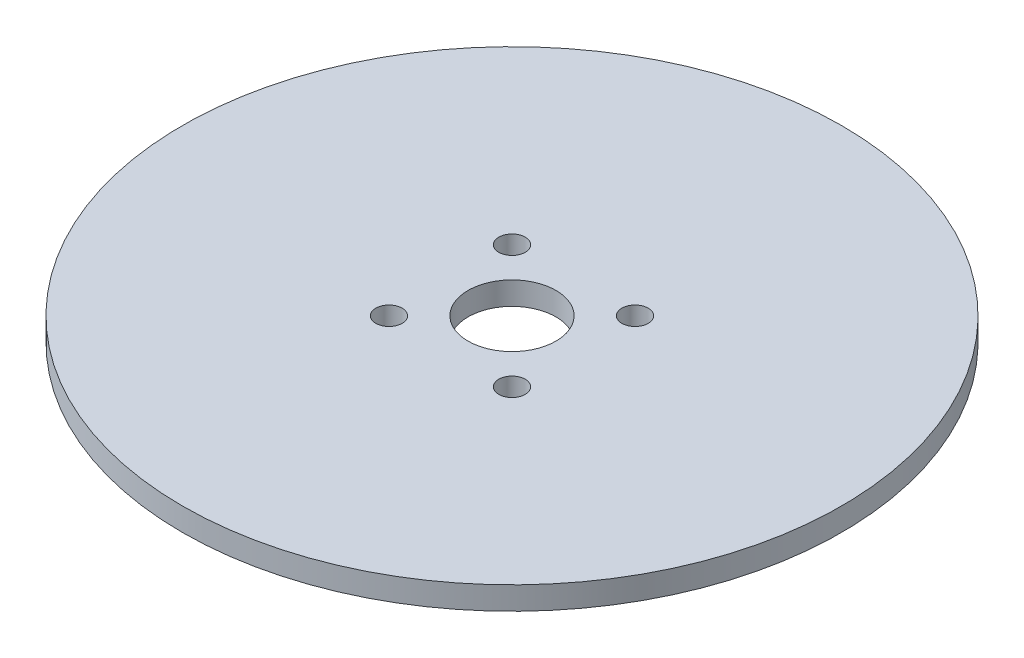
ISO-10303-21;
HEADER;
FILE_DESCRIPTION(('STEP AP214'),'2;1');
FILE_NAME('part.step','',(''),(''),'','','');
FILE_SCHEMA(('AUTOMOTIVE_DESIGN { 1 0 10303 214 1 1 1 1 }'));
ENDSEC;
DATA;
#1=APPLICATION_CONTEXT('core data for automotive mechanical design processes');
#2=APPLICATION_PROTOCOL_DEFINITION('international standard','automotive_design',2000,#1);
#3=PRODUCT_CONTEXT('',#1,'mechanical');
#4=PRODUCT('Part','Part','',(#3));
#5=PRODUCT_RELATED_PRODUCT_CATEGORY('part','',(#4));
#6=PRODUCT_DEFINITION_FORMATION('','',#4);
#7=PRODUCT_DEFINITION_CONTEXT('part definition',#1,'design');
#8=PRODUCT_DEFINITION('design','',#6,#7);
#9=PRODUCT_DEFINITION_SHAPE('','',#8);
#10=(LENGTH_UNIT() NAMED_UNIT(*) SI_UNIT(.MILLI.,.METRE.));
#11=(NAMED_UNIT(*) PLANE_ANGLE_UNIT() SI_UNIT($,.RADIAN.));
#12=(NAMED_UNIT(*) SI_UNIT($,.STERADIAN.) SOLID_ANGLE_UNIT());
#13=UNCERTAINTY_MEASURE_WITH_UNIT(LENGTH_MEASURE(1.E-05),#10,'distance_accuracy_value','');
#14=(GEOMETRIC_REPRESENTATION_CONTEXT(3) GLOBAL_UNCERTAINTY_ASSIGNED_CONTEXT((#13)) GLOBAL_UNIT_ASSIGNED_CONTEXT((#10,
#11,#12)) REPRESENTATION_CONTEXT('',''));
#15=CARTESIAN_POINT('',(0.,0.,0.));
#16=DIRECTION('',(0.,0.,1.));
#17=DIRECTION('',(1.,0.,0.));
#18=AXIS2_PLACEMENT_3D('',#15,#16,#17);
#19=CARTESIAN_POINT('',(0.,2.61,0.));
#20=DIRECTION('',(0.,-1.,0.));
#21=DIRECTION('',(0.,0.,-1.));
#22=AXIS2_PLACEMENT_3D('',#19,#20,#21);
#23=CYLINDRICAL_SURFACE('',#22,37.5);
#24=CARTESIAN_POINT('',(0.,2.61,0.));
#25=DIRECTION('',(0.,1.,0.));
#26=DIRECTION('',(0.,0.,1.));
#27=AXIS2_PLACEMENT_3D('',#24,#25,#26);
#28=CIRCLE('',#27,37.5);
#29=CARTESIAN_POINT('',(0.,2.61,37.5));
#30=VERTEX_POINT('',#29);
#31=EDGE_CURVE('E10',#30,#30,#28,.T.);
#32=ORIENTED_EDGE('',*,*,#31,.F.);
#33=EDGE_LOOP('',(#32));
#34=FACE_BOUND('',#33,.T.);
#35=CARTESIAN_POINT('',(0.,0.,0.));
#36=DIRECTION('',(0.,1.,0.));
#37=DIRECTION('',(0.,0.,1.));
#38=AXIS2_PLACEMENT_3D('',#35,#36,#37);
#39=CIRCLE('',#38,37.5);
#40=CARTESIAN_POINT('',(0.,0.,37.5));
#41=VERTEX_POINT('',#40);
#42=EDGE_CURVE('E45',#41,#41,#39,.T.);
#43=ORIENTED_EDGE('',*,*,#42,.T.);
#44=EDGE_LOOP('',(#43));
#45=FACE_BOUND('',#44,.T.);
#46=ADVANCED_FACE('F37',(#34,#45),#23,.T.);
#47=CARTESIAN_POINT('',(0.,2.61,0.));
#48=DIRECTION('',(0.,1.,0.));
#49=DIRECTION('',(0.,0.,1.));
#50=AXIS2_PLACEMENT_3D('',#47,#48,#49);
#51=PLANE('',#50);
#52=CARTESIAN_POINT('',(7.,2.61,7.));
#53=DIRECTION('',(0.,1.,0.));
#54=DIRECTION('',(0.,0.,1.));
#55=AXIS2_PLACEMENT_3D('',#52,#53,#54);
#56=CIRCLE('',#55,1.5);
#57=CARTESIAN_POINT('',(7.,2.61,8.5));
#58=VERTEX_POINT('',#57);
#59=EDGE_CURVE('E74',#58,#58,#56,.T.);
#60=ORIENTED_EDGE('',*,*,#59,.F.);
#61=EDGE_LOOP('',(#60));
#62=FACE_BOUND('',#61,.T.);
#63=CARTESIAN_POINT('',(-7.,2.61,-7.));
#64=DIRECTION('',(0.,1.,0.));
#65=DIRECTION('',(0.,0.,1.));
#66=AXIS2_PLACEMENT_3D('',#63,#64,#65);
#67=CIRCLE('',#66,1.5);
#68=CARTESIAN_POINT('',(-7.,2.61,-5.5));
#69=VERTEX_POINT('',#68);
#70=EDGE_CURVE('E65',#69,#69,#67,.T.);
#71=ORIENTED_EDGE('',*,*,#70,.F.);
#72=EDGE_LOOP('',(#71));
#73=FACE_BOUND('',#72,.T.);
#74=CARTESIAN_POINT('',(-7.,2.61,7.));
#75=DIRECTION('',(0.,1.,0.));
#76=DIRECTION('',(0.,0.,1.));
#77=AXIS2_PLACEMENT_3D('',#74,#75,#76);
#78=CIRCLE('',#77,1.5);
#79=CARTESIAN_POINT('',(-7.,2.61,8.5));
#80=VERTEX_POINT('',#79);
#81=EDGE_CURVE('E81',#80,#80,#78,.T.);
#82=ORIENTED_EDGE('',*,*,#81,.F.);
#83=EDGE_LOOP('',(#82));
#84=FACE_BOUND('',#83,.T.);
#85=CARTESIAN_POINT('',(7.,2.61,-7.));
#86=DIRECTION('',(0.,1.,0.));
#87=DIRECTION('',(0.,0.,1.));
#88=AXIS2_PLACEMENT_3D('',#85,#86,#87);
#89=CIRCLE('',#88,1.5);
#90=CARTESIAN_POINT('',(7.,2.61,-5.5));
#91=VERTEX_POINT('',#90);
#92=EDGE_CURVE('E57',#91,#91,#89,.T.);
#93=ORIENTED_EDGE('',*,*,#92,.F.);
#94=EDGE_LOOP('',(#93));
#95=FACE_BOUND('',#94,.T.);
#96=CARTESIAN_POINT('',(0.,2.61,0.));
#97=DIRECTION('',(0.,1.,0.));
#98=DIRECTION('',(0.,0.,1.));
#99=AXIS2_PLACEMENT_3D('',#96,#97,#98);
#100=CIRCLE('',#99,5.);
#101=CARTESIAN_POINT('',(0.,2.61,5.));
#102=VERTEX_POINT('',#101);
#103=EDGE_CURVE('E52',#102,#102,#100,.T.);
#104=ORIENTED_EDGE('',*,*,#103,.F.);
#105=EDGE_LOOP('',(#104));
#106=FACE_BOUND('',#105,.T.);
#107=ORIENTED_EDGE('',*,*,#31,.T.);
#108=EDGE_LOOP('',(#107));
#109=FACE_BOUND('',#108,.T.);
#110=ADVANCED_FACE('F100',(#62,#73,#84,#95,#106,#109),#51,.T.);
#111=CARTESIAN_POINT('',(0.,0.,0.));
#112=DIRECTION('',(0.,1.,0.));
#113=DIRECTION('',(0.,0.,1.));
#114=AXIS2_PLACEMENT_3D('',#111,#112,#113);
#115=PLANE('',#114);
#116=CARTESIAN_POINT('',(7.,0.,7.));
#117=DIRECTION('',(0.,1.,0.));
#118=DIRECTION('',(0.,0.,1.));
#119=AXIS2_PLACEMENT_3D('',#116,#117,#118);
#120=CIRCLE('',#119,1.5);
#121=CARTESIAN_POINT('',(7.,0.,8.5));
#122=VERTEX_POINT('',#121);
#123=EDGE_CURVE('E61',#122,#122,#120,.T.);
#124=ORIENTED_EDGE('',*,*,#123,.T.);
#125=EDGE_LOOP('',(#124));
#126=FACE_BOUND('',#125,.T.);
#127=CARTESIAN_POINT('',(-7.,0.,-7.));
#128=DIRECTION('',(0.,1.,0.));
#129=DIRECTION('',(0.,0.,1.));
#130=AXIS2_PLACEMENT_3D('',#127,#128,#129);
#131=CIRCLE('',#130,1.5);
#132=CARTESIAN_POINT('',(-7.,0.,-5.5));
#133=VERTEX_POINT('',#132);
#134=EDGE_CURVE('E69',#133,#133,#131,.T.);
#135=ORIENTED_EDGE('',*,*,#134,.T.);
#136=EDGE_LOOP('',(#135));
#137=FACE_BOUND('',#136,.T.);
#138=CARTESIAN_POINT('',(-7.,0.,7.));
#139=DIRECTION('',(0.,1.,0.));
#140=DIRECTION('',(0.,0.,1.));
#141=AXIS2_PLACEMENT_3D('',#138,#139,#140);
#142=CIRCLE('',#141,1.5);
#143=CARTESIAN_POINT('',(-7.,0.,8.5));
#144=VERTEX_POINT('',#143);
#145=EDGE_CURVE('E70',#144,#144,#142,.T.);
#146=ORIENTED_EDGE('',*,*,#145,.T.);
#147=EDGE_LOOP('',(#146));
#148=FACE_BOUND('',#147,.T.);
#149=CARTESIAN_POINT('',(7.,0.,-7.));
#150=DIRECTION('',(0.,1.,0.));
#151=DIRECTION('',(0.,0.,1.));
#152=AXIS2_PLACEMENT_3D('',#149,#150,#151);
#153=CIRCLE('',#152,1.5);
#154=CARTESIAN_POINT('',(7.,0.,-5.5));
#155=VERTEX_POINT('',#154);
#156=EDGE_CURVE('E56',#155,#155,#153,.T.);
#157=ORIENTED_EDGE('',*,*,#156,.T.);
#158=EDGE_LOOP('',(#157));
#159=FACE_BOUND('',#158,.T.);
#160=CARTESIAN_POINT('',(0.,0.,0.));
#161=DIRECTION('',(0.,1.,0.));
#162=DIRECTION('',(0.,0.,1.));
#163=AXIS2_PLACEMENT_3D('',#160,#161,#162);
#164=CIRCLE('',#163,5.);
#165=CARTESIAN_POINT('',(0.,0.,5.));
#166=VERTEX_POINT('',#165);
#167=EDGE_CURVE('E40',#166,#166,#164,.T.);
#168=ORIENTED_EDGE('',*,*,#167,.T.);
#169=EDGE_LOOP('',(#168));
#170=FACE_BOUND('',#169,.T.);
#171=ORIENTED_EDGE('',*,*,#42,.F.);
#172=EDGE_LOOP('',(#171));
#173=FACE_BOUND('',#172,.T.);
#174=ADVANCED_FACE('F89',(#126,#137,#148,#159,#170,#173),#115,.F.);
#175=CARTESIAN_POINT('',(0.,-10.44,0.));
#176=DIRECTION('',(0.,1.,0.));
#177=DIRECTION('',(0.,0.,1.));
#178=AXIS2_PLACEMENT_3D('',#175,#176,#177);
#179=CYLINDRICAL_SURFACE('',#178,5.);
#180=ORIENTED_EDGE('',*,*,#103,.T.);
#181=EDGE_LOOP('',(#180));
#182=FACE_BOUND('',#181,.T.);
#183=ORIENTED_EDGE('',*,*,#167,.F.);
#184=EDGE_LOOP('',(#183));
#185=FACE_BOUND('',#184,.T.);
#186=ADVANCED_FACE('F109',(#182,#185),#179,.F.);
#187=CARTESIAN_POINT('',(7.,0.,-7.));
#188=DIRECTION('',(0.,1.,0.));
#189=DIRECTION('',(0.,0.,1.));
#190=AXIS2_PLACEMENT_3D('',#187,#188,#189);
#191=CYLINDRICAL_SURFACE('',#190,1.5);
#192=ORIENTED_EDGE('',*,*,#156,.F.);
#193=EDGE_LOOP('',(#192));
#194=FACE_BOUND('',#193,.T.);
#195=ORIENTED_EDGE('',*,*,#92,.T.);
#196=EDGE_LOOP('',(#195));
#197=FACE_BOUND('',#196,.T.);
#198=ADVANCED_FACE('F96',(#194,#197),#191,.F.);
#199=CARTESIAN_POINT('',(-7.,0.,7.));
#200=DIRECTION('',(0.,1.,0.));
#201=DIRECTION('',(0.,0.,1.));
#202=AXIS2_PLACEMENT_3D('',#199,#200,#201);
#203=CYLINDRICAL_SURFACE('',#202,1.5);
#204=ORIENTED_EDGE('',*,*,#145,.F.);
#205=EDGE_LOOP('',(#204));
#206=FACE_BOUND('',#205,.T.);
#207=ORIENTED_EDGE('',*,*,#81,.T.);
#208=EDGE_LOOP('',(#207));
#209=FACE_BOUND('',#208,.T.);
#210=ADVANCED_FACE('F92',(#206,#209),#203,.F.);
#211=CARTESIAN_POINT('',(-7.,0.,-7.));
#212=DIRECTION('',(0.,1.,0.));
#213=DIRECTION('',(0.,0.,1.));
#214=AXIS2_PLACEMENT_3D('',#211,#212,#213);
#215=CYLINDRICAL_SURFACE('',#214,1.5);
#216=ORIENTED_EDGE('',*,*,#134,.F.);
#217=EDGE_LOOP('',(#216));
#218=FACE_BOUND('',#217,.T.);
#219=ORIENTED_EDGE('',*,*,#70,.T.);
#220=EDGE_LOOP('',(#219));
#221=FACE_BOUND('',#220,.T.);
#222=ADVANCED_FACE('F95',(#218,#221),#215,.F.);
#223=CARTESIAN_POINT('',(7.,0.,7.));
#224=DIRECTION('',(0.,1.,0.));
#225=DIRECTION('',(0.,0.,1.));
#226=AXIS2_PLACEMENT_3D('',#223,#224,#225);
#227=CYLINDRICAL_SURFACE('',#226,1.5);
#228=ORIENTED_EDGE('',*,*,#123,.F.);
#229=EDGE_LOOP('',(#228));
#230=FACE_BOUND('',#229,.T.);
#231=ORIENTED_EDGE('',*,*,#59,.T.);
#232=EDGE_LOOP('',(#231));
#233=FACE_BOUND('',#232,.T.);
#234=ADVANCED_FACE('F155',(#230,#233),#227,.F.);
#235=CLOSED_SHELL('',(#46,#110,#174,#186,#198,#210,#222,#234));
#236=MANIFOLD_SOLID_BREP('B2',#235);
#237=ADVANCED_BREP_SHAPE_REPRESENTATION('',(#18,#236),#14);
#238=SHAPE_DEFINITION_REPRESENTATION(#9,#237);
ENDSEC;
END-ISO-10303-21;
